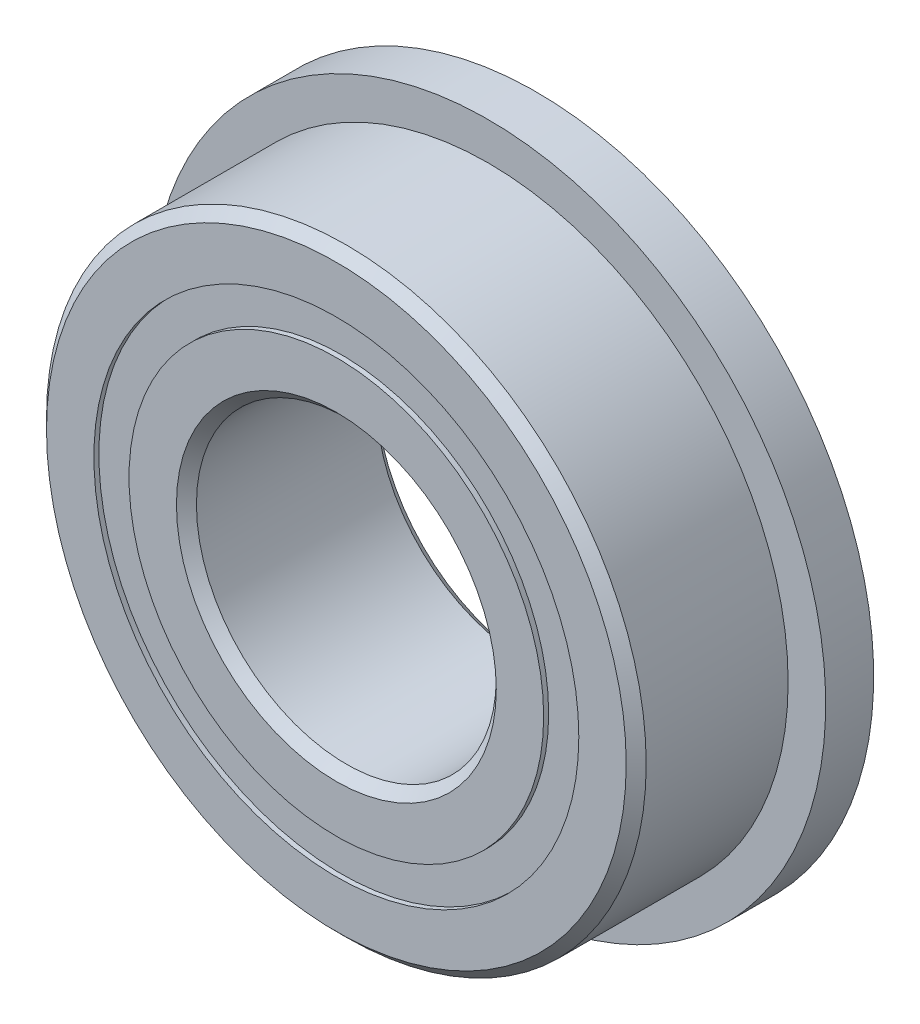
ISO-10303-21;
HEADER;
FILE_DESCRIPTION(('STEP AP214'),'2;1');
FILE_NAME('part.step','',(''),(''),'','','');
FILE_SCHEMA(('AUTOMOTIVE_DESIGN { 1 0 10303 214 1 1 1 1 }'));
ENDSEC;
DATA;
#1=APPLICATION_CONTEXT('core data for automotive mechanical design processes');
#2=APPLICATION_PROTOCOL_DEFINITION('international standard','automotive_design',2000,#1);
#3=PRODUCT_CONTEXT('',#1,'mechanical');
#4=PRODUCT('Part','Part','',(#3));
#5=PRODUCT_RELATED_PRODUCT_CATEGORY('part','',(#4));
#6=PRODUCT_DEFINITION_FORMATION('','',#4);
#7=PRODUCT_DEFINITION_CONTEXT('part definition',#1,'design');
#8=PRODUCT_DEFINITION('design','',#6,#7);
#9=PRODUCT_DEFINITION_SHAPE('','',#8);
#10=(LENGTH_UNIT() NAMED_UNIT(*) SI_UNIT(.MILLI.,.METRE.));
#11=(NAMED_UNIT(*) PLANE_ANGLE_UNIT() SI_UNIT($,.RADIAN.));
#12=(NAMED_UNIT(*) SI_UNIT($,.STERADIAN.) SOLID_ANGLE_UNIT());
#13=UNCERTAINTY_MEASURE_WITH_UNIT(LENGTH_MEASURE(1.E-05),#10,'distance_accuracy_value','');
#14=(GEOMETRIC_REPRESENTATION_CONTEXT(3) GLOBAL_UNCERTAINTY_ASSIGNED_CONTEXT((#13)) GLOBAL_UNIT_ASSIGNED_CONTEXT((#10,
#11,#12)) REPRESENTATION_CONTEXT('',''));
#15=CARTESIAN_POINT('',(0.,0.,0.));
#16=DIRECTION('',(0.,0.,1.));
#17=DIRECTION('',(1.,0.,0.));
#18=AXIS2_PLACEMENT_3D('',#15,#16,#17);
#19=CARTESIAN_POINT('',(0.,3.85099587912088,-1.508125));
#20=DIRECTION('',(0.,0.,1.));
#21=DIRECTION('',(1.,0.,0.));
#22=AXIS2_PLACEMENT_3D('',#19,#20,#21);
#23=PLANE('',#22);
#24=CARTESIAN_POINT('',(0.,0.,-1.508125));
#25=DIRECTION('',(0.,0.,1.));
#26=DIRECTION('',(1.,0.,0.));
#27=AXIS2_PLACEMENT_3D('',#24,#25,#26);
#28=CIRCLE('',#27,3.85099587912088);
#29=CARTESIAN_POINT('',(3.85099587912088,0.,-1.508125));
#30=VERTEX_POINT('',#29);
#31=EDGE_CURVE('E60',#30,#30,#28,.T.);
#32=ORIENTED_EDGE('',*,*,#31,.F.);
#33=EDGE_LOOP('',(#32));
#34=FACE_BOUND('',#33,.T.);
#35=CARTESIAN_POINT('',(0.,0.,-1.508125));
#36=DIRECTION('',(0.,0.,1.));
#37=DIRECTION('',(1.,0.,0.));
#38=AXIS2_PLACEMENT_3D('',#35,#36,#37);
#39=CIRCLE('',#38,3.29275412087912);
#40=CARTESIAN_POINT('',(3.29275412087912,0.,-1.508125));
#41=VERTEX_POINT('',#40);
#42=EDGE_CURVE('E11',#41,#41,#39,.T.);
#43=ORIENTED_EDGE('',*,*,#42,.T.);
#44=EDGE_LOOP('',(#43));
#45=FACE_BOUND('',#44,.T.);
#46=ADVANCED_FACE('F46',(#34,#45),#23,.F.);
#47=CARTESIAN_POINT('',(0.,0.,1.5875));
#48=DIRECTION('',(0.,0.,1.));
#49=DIRECTION('',(1.,0.,0.));
#50=AXIS2_PLACEMENT_3D('',#47,#48,#49);
#51=CYLINDRICAL_SURFACE('',#50,3.29275412087912);
#52=ORIENTED_EDGE('',*,*,#42,.F.);
#53=EDGE_LOOP('',(#52));
#54=FACE_BOUND('',#53,.T.);
#55=CARTESIAN_POINT('',(0.,0.,-0.758760243513405));
#56=DIRECTION('',(0.,0.,1.));
#57=DIRECTION('',(1.,0.,0.));
#58=AXIS2_PLACEMENT_3D('',#55,#56,#57);
#59=CIRCLE('',#58,3.29275412087912);
#60=CARTESIAN_POINT('',(3.29275412087912,0.,-0.758760243513405));
#61=VERTEX_POINT('',#60);
#62=EDGE_CURVE('E52',#61,#61,#59,.T.);
#63=ORIENTED_EDGE('',*,*,#62,.T.);
#64=EDGE_LOOP('',(#63));
#65=FACE_BOUND('',#64,.T.);
#66=ADVANCED_FACE('F69',(#54,#65),#51,.F.);
#67=CARTESIAN_POINT('',(0.,3.85099587912088,-0.758760243513405));
#68=DIRECTION('',(0.,0.,-1.));
#69=DIRECTION('',(-1.,0.,0.));
#70=AXIS2_PLACEMENT_3D('',#67,#68,#69);
#71=PLANE('',#70);
#72=ORIENTED_EDGE('',*,*,#62,.F.);
#73=EDGE_LOOP('',(#72));
#74=FACE_BOUND('',#73,.T.);
#75=CARTESIAN_POINT('',(0.,0.,-0.758760243513405));
#76=DIRECTION('',(0.,0.,1.));
#77=DIRECTION('',(1.,0.,0.));
#78=AXIS2_PLACEMENT_3D('',#75,#76,#77);
#79=CIRCLE('',#78,3.85099587912088);
#80=CARTESIAN_POINT('',(3.85099587912088,0.,-0.758760243513405));
#81=VERTEX_POINT('',#80);
#82=EDGE_CURVE('E56',#81,#81,#79,.T.);
#83=ORIENTED_EDGE('',*,*,#82,.T.);
#84=EDGE_LOOP('',(#83));
#85=FACE_BOUND('',#84,.T.);
#86=ADVANCED_FACE('F73',(#74,#85),#71,.F.);
#87=CARTESIAN_POINT('',(0.,0.,1.5875));
#88=DIRECTION('',(0.,0.,1.));
#89=DIRECTION('',(1.,0.,0.));
#90=AXIS2_PLACEMENT_3D('',#87,#88,#89);
#91=CYLINDRICAL_SURFACE('',#90,3.85099587912088);
#92=ORIENTED_EDGE('',*,*,#82,.F.);
#93=EDGE_LOOP('',(#92));
#94=FACE_BOUND('',#93,.T.);
#95=ORIENTED_EDGE('',*,*,#31,.T.);
#96=EDGE_LOOP('',(#95));
#97=FACE_BOUND('',#96,.T.);
#98=ADVANCED_FACE('F66',(#94,#97),#91,.T.);
#99=CLOSED_SHELL('',(#46,#66,#86,#98));
#100=MANIFOLD_SOLID_BREP('B2',#99);
#101=CARTESIAN_POINT('',(0.,3.85099587912088,1.508125));
#102=DIRECTION('',(0.,0.,-1.));
#103=DIRECTION('',(-1.,0.,0.));
#104=AXIS2_PLACEMENT_3D('',#101,#102,#103);
#105=PLANE('',#104);
#106=CARTESIAN_POINT('',(0.,0.,1.508125));
#107=DIRECTION('',(0.,0.,1.));
#108=DIRECTION('',(1.,0.,0.));
#109=AXIS2_PLACEMENT_3D('',#106,#107,#108);
#110=CIRCLE('',#109,3.29275412087912);
#111=CARTESIAN_POINT('',(3.29275412087912,0.,1.508125));
#112=VERTEX_POINT('',#111);
#113=EDGE_CURVE('E45',#112,#112,#110,.T.);
#114=ORIENTED_EDGE('',*,*,#113,.F.);
#115=EDGE_LOOP('',(#114));
#116=FACE_BOUND('',#115,.T.);
#117=CARTESIAN_POINT('',(0.,0.,1.508125));
#118=DIRECTION('',(0.,0.,1.));
#119=DIRECTION('',(1.,0.,0.));
#120=AXIS2_PLACEMENT_3D('',#117,#118,#119);
#121=CIRCLE('',#120,3.85099587912088);
#122=CARTESIAN_POINT('',(3.85099587912088,0.,1.508125));
#123=VERTEX_POINT('',#122);
#124=EDGE_CURVE('E128',#123,#123,#121,.T.);
#125=ORIENTED_EDGE('',*,*,#124,.T.);
#126=EDGE_LOOP('',(#125));
#127=FACE_BOUND('',#126,.T.);
#128=ADVANCED_FACE('F114',(#116,#127),#105,.F.);
#129=CARTESIAN_POINT('',(0.,0.,1.5875));
#130=DIRECTION('',(0.,0.,1.));
#131=DIRECTION('',(1.,0.,0.));
#132=AXIS2_PLACEMENT_3D('',#129,#130,#131);
#133=CYLINDRICAL_SURFACE('',#132,3.29275412087912);
#134=CARTESIAN_POINT('',(0.,0.,0.758760243513404));
#135=DIRECTION('',(0.,0.,1.));
#136=DIRECTION('',(1.,0.,0.));
#137=AXIS2_PLACEMENT_3D('',#134,#135,#136);
#138=CIRCLE('',#137,3.29275412087912);
#139=CARTESIAN_POINT('',(3.29275412087912,0.,0.758760243513404));
#140=VERTEX_POINT('',#139);
#141=EDGE_CURVE('E120',#140,#140,#138,.T.);
#142=ORIENTED_EDGE('',*,*,#141,.F.);
#143=EDGE_LOOP('',(#142));
#144=FACE_BOUND('',#143,.T.);
#145=ORIENTED_EDGE('',*,*,#113,.T.);
#146=EDGE_LOOP('',(#145));
#147=FACE_BOUND('',#146,.T.);
#148=ADVANCED_FACE('F143',(#144,#147),#133,.F.);
#149=CARTESIAN_POINT('',(0.,3.85099587912088,0.758760243513405));
#150=DIRECTION('',(0.,0.,1.));
#151=DIRECTION('',(1.,0.,0.));
#152=AXIS2_PLACEMENT_3D('',#149,#150,#151);
#153=PLANE('',#152);
#154=CARTESIAN_POINT('',(0.,0.,0.758760243513405));
#155=DIRECTION('',(0.,0.,1.));
#156=DIRECTION('',(1.,0.,0.));
#157=AXIS2_PLACEMENT_3D('',#154,#155,#156);
#158=CIRCLE('',#157,3.85099587912088);
#159=CARTESIAN_POINT('',(3.85099587912088,0.,0.758760243513405));
#160=VERTEX_POINT('',#159);
#161=EDGE_CURVE('E124',#160,#160,#158,.T.);
#162=ORIENTED_EDGE('',*,*,#161,.F.);
#163=EDGE_LOOP('',(#162));
#164=FACE_BOUND('',#163,.T.);
#165=ORIENTED_EDGE('',*,*,#141,.T.);
#166=EDGE_LOOP('',(#165));
#167=FACE_BOUND('',#166,.T.);
#168=ADVANCED_FACE('F138',(#164,#167),#153,.F.);
#169=CARTESIAN_POINT('',(0.,0.,1.5875));
#170=DIRECTION('',(0.,0.,1.));
#171=DIRECTION('',(1.,0.,0.));
#172=AXIS2_PLACEMENT_3D('',#169,#170,#171);
#173=CYLINDRICAL_SURFACE('',#172,3.85099587912088);
#174=ORIENTED_EDGE('',*,*,#124,.F.);
#175=EDGE_LOOP('',(#174));
#176=FACE_BOUND('',#175,.T.);
#177=ORIENTED_EDGE('',*,*,#161,.T.);
#178=EDGE_LOOP('',(#177));
#179=FACE_BOUND('',#178,.T.);
#180=ADVANCED_FACE('F135',(#176,#179),#173,.T.);
#181=CLOSED_SHELL('',(#128,#148,#168,#180));
#182=MANIFOLD_SOLID_BREP('B6',#181);
#183=CARTESIAN_POINT('',(-1.78593749999996,3.09333448914257,0.));
#184=DIRECTION('',(0.,0.,1.));
#185=DIRECTION('',(-0.499999999999989,0.866025403784445,0.));
#186=AXIS2_PLACEMENT_3D('',#183,#184,#185);
#187=SPHERICAL_SURFACE('',#186,0.758760243513405);
#188=CARTESIAN_POINT('',(-1.78593749999996,3.09333448914257,0.758760243513405));
#189=VERTEX_POINT('',#188);
#190=VERTEX_LOOP('',#189);
#191=FACE_BOUND('',#190,.T.);
#192=ADVANCED_FACE('F182',(#191),#187,.T.);
#193=CLOSED_SHELL('',(#192));
#194=MANIFOLD_SOLID_BREP('B40',#193);
#195=CARTESIAN_POINT('',(-3.09333448914252,1.78593750000004,0.));
#196=DIRECTION('',(0.,0.,1.));
#197=DIRECTION('',(-0.866025403784433,0.50000000000001,0.));
#198=AXIS2_PLACEMENT_3D('',#195,#196,#197);
#199=SPHERICAL_SURFACE('',#198,0.758760243513405);
#200=CARTESIAN_POINT('',(-3.09333448914252,1.78593750000004,0.758760243513405));
#201=VERTEX_POINT('',#200);
#202=VERTEX_LOOP('',#201);
#203=FACE_BOUND('',#202,.T.);
#204=ADVANCED_FACE('F203',(#203),#199,.T.);
#205=CLOSED_SHELL('',(#204));
#206=MANIFOLD_SOLID_BREP('B110',#205);
#207=CARTESIAN_POINT('',(-3.571875,0.,0.));
#208=DIRECTION('',(0.,0.,1.));
#209=DIRECTION('',(-1.,0.,0.));
#210=AXIS2_PLACEMENT_3D('',#207,#208,#209);
#211=SPHERICAL_SURFACE('',#210,0.758760243513405);
#212=CARTESIAN_POINT('',(-3.571875,0.,0.758760243513405));
#213=VERTEX_POINT('',#212);
#214=VERTEX_LOOP('',#213);
#215=FACE_BOUND('',#214,.T.);
#216=ADVANCED_FACE('F224',(#215),#211,.T.);
#217=CLOSED_SHELL('',(#216));
#218=MANIFOLD_SOLID_BREP('B178',#217);
#219=CARTESIAN_POINT('',(-3.09333448914256,-1.78593749999997,0.));
#220=DIRECTION('',(0.,0.,1.));
#221=DIRECTION('',(-0.866025403784443,-0.499999999999992,0.));
#222=AXIS2_PLACEMENT_3D('',#219,#220,#221);
#223=SPHERICAL_SURFACE('',#222,0.758760243513405);
#224=CARTESIAN_POINT('',(-3.09333448914256,-1.78593749999997,0.758760243513405));
#225=VERTEX_POINT('',#224);
#226=VERTEX_LOOP('',#225);
#227=FACE_BOUND('',#226,.T.);
#228=ADVANCED_FACE('F245',(#227),#223,.T.);
#229=CLOSED_SHELL('',(#228));
#230=MANIFOLD_SOLID_BREP('B199',#229);
#231=CARTESIAN_POINT('',(-1.78593750000003,-3.09333448914253,0.));
#232=DIRECTION('',(0.,0.,1.));
#233=DIRECTION('',(-0.500000000000007,-0.866025403784435,0.));
#234=AXIS2_PLACEMENT_3D('',#231,#232,#233);
#235=SPHERICAL_SURFACE('',#234,0.758760243513405);
#236=CARTESIAN_POINT('',(-1.78593750000003,-3.09333448914253,0.758760243513405));
#237=VERTEX_POINT('',#236);
#238=VERTEX_LOOP('',#237);
#239=FACE_BOUND('',#238,.T.);
#240=ADVANCED_FACE('F266',(#239),#235,.T.);
#241=CLOSED_SHELL('',(#240));
#242=MANIFOLD_SOLID_BREP('B220',#241);
#243=CARTESIAN_POINT('',(0.,-3.571875,0.));
#244=DIRECTION('',(0.,0.,1.));
#245=DIRECTION('',(0.,-1.,0.));
#246=AXIS2_PLACEMENT_3D('',#243,#244,#245);
#247=SPHERICAL_SURFACE('',#246,0.758760243513405);
#248=CARTESIAN_POINT('',(0.,-3.571875,0.758760243513405));
#249=VERTEX_POINT('',#248);
#250=VERTEX_LOOP('',#249);
#251=FACE_BOUND('',#250,.T.);
#252=ADVANCED_FACE('F287',(#251),#247,.T.);
#253=CLOSED_SHELL('',(#252));
#254=MANIFOLD_SOLID_BREP('B241',#253);
#255=CARTESIAN_POINT('',(1.78593749999998,-3.09333448914255,0.));
#256=DIRECTION('',(0.,0.,1.));
#257=DIRECTION('',(0.499999999999995,-0.866025403784442,0.));
#258=AXIS2_PLACEMENT_3D('',#255,#256,#257);
#259=SPHERICAL_SURFACE('',#258,0.758760243513405);
#260=CARTESIAN_POINT('',(1.78593749999998,-3.09333448914255,0.758760243513405));
#261=VERTEX_POINT('',#260);
#262=VERTEX_LOOP('',#261);
#263=FACE_BOUND('',#262,.T.);
#264=ADVANCED_FACE('F308',(#263),#259,.T.);
#265=CLOSED_SHELL('',(#264));
#266=MANIFOLD_SOLID_BREP('B262',#265);
#267=CARTESIAN_POINT('',(3.09333448914253,-1.78593750000001,0.));
#268=DIRECTION('',(0.,0.,1.));
#269=DIRECTION('',(0.866025403784436,-0.500000000000004,0.));
#270=AXIS2_PLACEMENT_3D('',#267,#268,#269);
#271=SPHERICAL_SURFACE('',#270,0.758760243513405);
#272=CARTESIAN_POINT('',(3.09333448914253,-1.78593750000001,0.758760243513405));
#273=VERTEX_POINT('',#272);
#274=VERTEX_LOOP('',#273);
#275=FACE_BOUND('',#274,.T.);
#276=ADVANCED_FACE('F329',(#275),#271,.T.);
#277=CLOSED_SHELL('',(#276));
#278=MANIFOLD_SOLID_BREP('B283',#277);
#279=CARTESIAN_POINT('',(3.571875,0.,0.));
#280=DIRECTION('',(0.,0.,1.));
#281=DIRECTION('',(1.,0.,0.));
#282=AXIS2_PLACEMENT_3D('',#279,#280,#281);
#283=SPHERICAL_SURFACE('',#282,0.758760243513405);
#284=CARTESIAN_POINT('',(3.571875,0.,0.758760243513405));
#285=VERTEX_POINT('',#284);
#286=VERTEX_LOOP('',#285);
#287=FACE_BOUND('',#286,.T.);
#288=ADVANCED_FACE('F350',(#287),#283,.T.);
#289=CLOSED_SHELL('',(#288));
#290=MANIFOLD_SOLID_BREP('B304',#289);
#291=CARTESIAN_POINT('',(3.09333448914255,1.78593749999999,0.));
#292=DIRECTION('',(0.,0.,1.));
#293=DIRECTION('',(0.86602540378444,0.499999999999998,0.));
#294=AXIS2_PLACEMENT_3D('',#291,#292,#293);
#295=SPHERICAL_SURFACE('',#294,0.758760243513405);
#296=CARTESIAN_POINT('',(3.09333448914255,1.78593749999999,0.758760243513405));
#297=VERTEX_POINT('',#296);
#298=VERTEX_LOOP('',#297);
#299=FACE_BOUND('',#298,.T.);
#300=ADVANCED_FACE('F371',(#299),#295,.T.);
#301=CLOSED_SHELL('',(#300));
#302=MANIFOLD_SOLID_BREP('B325',#301);
#303=CARTESIAN_POINT('',(1.7859375,3.09333448914254,0.));
#304=DIRECTION('',(0.,0.,1.));
#305=DIRECTION('',(0.500000000000001,0.866025403784438,0.));
#306=AXIS2_PLACEMENT_3D('',#303,#304,#305);
#307=SPHERICAL_SURFACE('',#306,0.758760243513405);
#308=CARTESIAN_POINT('',(1.7859375,3.09333448914254,0.758760243513405));
#309=VERTEX_POINT('',#308);
#310=VERTEX_LOOP('',#309);
#311=FACE_BOUND('',#310,.T.);
#312=ADVANCED_FACE('F392',(#311),#307,.T.);
#313=CLOSED_SHELL('',(#312));
#314=MANIFOLD_SOLID_BREP('B346',#313);
#315=CARTESIAN_POINT('',(0.,3.571875,0.));
#316=DIRECTION('',(0.,0.,1.));
#317=DIRECTION('',(0.,1.,0.));
#318=AXIS2_PLACEMENT_3D('',#315,#316,#317);
#319=SPHERICAL_SURFACE('',#318,0.758760243513405);
#320=CARTESIAN_POINT('',(0.,3.571875,0.758760243513405));
#321=VERTEX_POINT('',#320);
#322=VERTEX_LOOP('',#321);
#323=FACE_BOUND('',#322,.T.);
#324=ADVANCED_FACE('F415',(#323),#319,.T.);
#325=CLOSED_SHELL('',(#324));
#326=MANIFOLD_SOLID_BREP('B367',#325);
#327=CARTESIAN_POINT('',(0.,3.29275412087912,1.5875));
#328=DIRECTION('',(0.,0.,-1.));
#329=DIRECTION('',(-1.,0.,0.));
#330=AXIS2_PLACEMENT_3D('',#327,#328,#329);
#331=PLANE('',#330);
#332=CARTESIAN_POINT('',(0.,0.,1.5875));
#333=DIRECTION('',(0.,0.,1.));
#334=DIRECTION('',(1.,0.,0.));
#335=AXIS2_PLACEMENT_3D('',#332,#333,#334);
#336=CIRCLE('',#335,2.54);
#337=CARTESIAN_POINT('',(2.54,0.,1.5875));
#338=VERTEX_POINT('',#337);
#339=EDGE_CURVE('E463',#338,#338,#336,.T.);
#340=ORIENTED_EDGE('',*,*,#339,.F.);
#341=EDGE_LOOP('',(#340));
#342=FACE_BOUND('',#341,.T.);
#343=CARTESIAN_POINT('',(0.,0.,1.5875));
#344=DIRECTION('',(0.,0.,1.));
#345=DIRECTION('',(1.,0.,0.));
#346=AXIS2_PLACEMENT_3D('',#343,#344,#345);
#347=CIRCLE('',#346,3.29275412087912);
#348=CARTESIAN_POINT('',(3.29275412087912,0.,1.5875));
#349=VERTEX_POINT('',#348);
#350=EDGE_CURVE('E414',#349,#349,#347,.T.);
#351=ORIENTED_EDGE('',*,*,#350,.T.);
#352=EDGE_LOOP('',(#351));
#353=FACE_BOUND('',#352,.T.);
#354=ADVANCED_FACE('F435',(#342,#353),#331,.F.);
#355=CARTESIAN_POINT('',(0.,0.,1.5875));
#356=DIRECTION('',(0.,0.,1.));
#357=DIRECTION('',(1.,0.,0.));
#358=AXIS2_PLACEMENT_3D('',#355,#356,#357);
#359=CYLINDRICAL_SURFACE('',#358,3.29275412087912);
#360=ORIENTED_EDGE('',*,*,#350,.F.);
#361=EDGE_LOOP('',(#360));
#362=FACE_BOUND('',#361,.T.);
#363=CARTESIAN_POINT('',(0.,0.,0.705555555555555));
#364=DIRECTION('',(0.,0.,1.));
#365=DIRECTION('',(1.,0.,0.));
#366=AXIS2_PLACEMENT_3D('',#363,#364,#365);
#367=CIRCLE('',#366,3.29275412087912);
#368=CARTESIAN_POINT('',(3.29275412087912,0.,0.705555555555555));
#369=VERTEX_POINT('',#368);
#370=EDGE_CURVE('E441',#369,#369,#367,.T.);
#371=ORIENTED_EDGE('',*,*,#370,.T.);
#372=EDGE_LOOP('',(#371));
#373=FACE_BOUND('',#372,.T.);
#374=ADVANCED_FACE('F470',(#362,#373),#359,.T.);
#375=CARTESIAN_POINT('',(0.,0.,0.));
#376=DIRECTION('',(0.,0.,1.));
#377=DIRECTION('',(1.,0.,0.));
#378=AXIS2_PLACEMENT_3D('',#375,#376,#377);
#379=TOROIDAL_SURFACE('',#378,3.571875,0.758760243513404);
#380=ORIENTED_EDGE('',*,*,#370,.F.);
#381=EDGE_LOOP('',(#380));
#382=FACE_BOUND('',#381,.T.);
#383=CARTESIAN_POINT('',(0.,0.,-0.705555555555556));
#384=DIRECTION('',(0.,0.,1.));
#385=DIRECTION('',(1.,0.,0.));
#386=AXIS2_PLACEMENT_3D('',#383,#384,#385);
#387=CIRCLE('',#386,3.29275412087912);
#388=CARTESIAN_POINT('',(3.29275412087912,0.,-0.705555555555556));
#389=VERTEX_POINT('',#388);
#390=EDGE_CURVE('E445',#389,#389,#387,.T.);
#391=ORIENTED_EDGE('',*,*,#390,.T.);
#392=EDGE_LOOP('',(#391));
#393=FACE_BOUND('',#392,.T.);
#394=ADVANCED_FACE('F474',(#382,#393),#379,.F.);
#395=CARTESIAN_POINT('',(0.,0.,1.5875));
#396=DIRECTION('',(0.,0.,1.));
#397=DIRECTION('',(1.,0.,0.));
#398=AXIS2_PLACEMENT_3D('',#395,#396,#397);
#399=CYLINDRICAL_SURFACE('',#398,3.29275412087912);
#400=ORIENTED_EDGE('',*,*,#390,.F.);
#401=EDGE_LOOP('',(#400));
#402=FACE_BOUND('',#401,.T.);
#403=CARTESIAN_POINT('',(0.,0.,-1.5875));
#404=DIRECTION('',(0.,0.,1.));
#405=DIRECTION('',(1.,0.,0.));
#406=AXIS2_PLACEMENT_3D('',#403,#404,#405);
#407=CIRCLE('',#406,3.29275412087912);
#408=CARTESIAN_POINT('',(3.29275412087912,0.,-1.5875));
#409=VERTEX_POINT('',#408);
#410=EDGE_CURVE('E449',#409,#409,#407,.T.);
#411=ORIENTED_EDGE('',*,*,#410,.T.);
#412=EDGE_LOOP('',(#411));
#413=FACE_BOUND('',#412,.T.);
#414=ADVANCED_FACE('F479',(#402,#413),#399,.T.);
#415=CARTESIAN_POINT('',(0.,2.54,-1.5875));
#416=DIRECTION('',(0.,0.,1.));
#417=DIRECTION('',(1.,0.,0.));
#418=AXIS2_PLACEMENT_3D('',#415,#416,#417);
#419=PLANE('',#418);
#420=ORIENTED_EDGE('',*,*,#410,.F.);
#421=EDGE_LOOP('',(#420));
#422=FACE_BOUND('',#421,.T.);
#423=CARTESIAN_POINT('',(0.,0.,-1.5875));
#424=DIRECTION('',(0.,0.,1.));
#425=DIRECTION('',(1.,0.,0.));
#426=AXIS2_PLACEMENT_3D('',#423,#424,#425);
#427=CIRCLE('',#426,2.54);
#428=CARTESIAN_POINT('',(2.54,0.,-1.5875));
#429=VERTEX_POINT('',#428);
#430=EDGE_CURVE('E454',#429,#429,#427,.T.);
#431=ORIENTED_EDGE('',*,*,#430,.T.);
#432=EDGE_LOOP('',(#431));
#433=FACE_BOUND('',#432,.T.);
#434=ADVANCED_FACE('F485',(#422,#433),#419,.F.);
#435=CARTESIAN_POINT('',(0.,0.,-1.42875));
#436=DIRECTION('',(0.,0.,-1.));
#437=DIRECTION('',(-1.,0.,0.));
#438=AXIS2_PLACEMENT_3D('',#435,#436,#437);
#439=CONICAL_SURFACE('',#438,2.38125,0.785398163397446);
#440=ORIENTED_EDGE('',*,*,#430,.F.);
#441=EDGE_LOOP('',(#440));
#442=FACE_BOUND('',#441,.T.);
#443=CARTESIAN_POINT('',(0.,0.,-1.42875));
#444=DIRECTION('',(0.,0.,1.));
#445=DIRECTION('',(1.,0.,0.));
#446=AXIS2_PLACEMENT_3D('',#443,#444,#445);
#447=CIRCLE('',#446,2.38125);
#448=CARTESIAN_POINT('',(2.38125,0.,-1.42875));
#449=VERTEX_POINT('',#448);
#450=EDGE_CURVE('E457',#449,#449,#447,.T.);
#451=ORIENTED_EDGE('',*,*,#450,.T.);
#452=EDGE_LOOP('',(#451));
#453=FACE_BOUND('',#452,.T.);
#454=ADVANCED_FACE('F489',(#442,#453),#439,.F.);
#455=CARTESIAN_POINT('',(0.,0.,1.5875));
#456=DIRECTION('',(0.,0.,1.));
#457=DIRECTION('',(1.,0.,0.));
#458=AXIS2_PLACEMENT_3D('',#455,#456,#457);
#459=CYLINDRICAL_SURFACE('',#458,2.38125);
#460=ORIENTED_EDGE('',*,*,#450,.F.);
#461=EDGE_LOOP('',(#460));
#462=FACE_BOUND('',#461,.T.);
#463=CARTESIAN_POINT('',(0.,0.,1.42875));
#464=DIRECTION('',(0.,0.,1.));
#465=DIRECTION('',(1.,0.,0.));
#466=AXIS2_PLACEMENT_3D('',#463,#464,#465);
#467=CIRCLE('',#466,2.38125);
#468=CARTESIAN_POINT('',(2.38125,0.,1.42875));
#469=VERTEX_POINT('',#468);
#470=EDGE_CURVE('E460',#469,#469,#467,.T.);
#471=ORIENTED_EDGE('',*,*,#470,.T.);
#472=EDGE_LOOP('',(#471));
#473=FACE_BOUND('',#472,.T.);
#474=ADVANCED_FACE('F493',(#462,#473),#459,.F.);
#475=CARTESIAN_POINT('',(0.,0.,1.5875));
#476=DIRECTION('',(0.,0.,1.));
#477=DIRECTION('',(1.,0.,0.));
#478=AXIS2_PLACEMENT_3D('',#475,#476,#477);
#479=CONICAL_SURFACE('',#478,2.54,0.78539816339745);
#480=ORIENTED_EDGE('',*,*,#470,.F.);
#481=EDGE_LOOP('',(#480));
#482=FACE_BOUND('',#481,.T.);
#483=ORIENTED_EDGE('',*,*,#339,.T.);
#484=EDGE_LOOP('',(#483));
#485=FACE_BOUND('',#484,.T.);
#486=ADVANCED_FACE('F467',(#482,#485),#479,.F.);
#487=CLOSED_SHELL('',(#354,#374,#394,#414,#434,#454,#474,#486));
#488=MANIFOLD_SOLID_BREP('B388',#487);
#489=CARTESIAN_POINT('',(0.,0.,1.42875));
#490=DIRECTION('',(0.,0.,-1.));
#491=DIRECTION('',(-1.,0.,0.));
#492=AXIS2_PLACEMENT_3D('',#489,#490,#491);
#493=CONICAL_SURFACE('',#492,4.7625,0.785398163397446);
#494=CARTESIAN_POINT('',(0.,0.,1.5875));
#495=DIRECTION('',(0.,0.,1.));
#496=DIRECTION('',(1.,0.,0.));
#497=AXIS2_PLACEMENT_3D('',#494,#495,#496);
#498=CIRCLE('',#497,4.60375);
#499=CARTESIAN_POINT('',(4.60375,0.,1.5875));
#500=VERTEX_POINT('',#499);
#501=EDGE_CURVE('E579',#500,#500,#498,.T.);
#502=ORIENTED_EDGE('',*,*,#501,.F.);
#503=EDGE_LOOP('',(#502));
#504=FACE_BOUND('',#503,.T.);
#505=CARTESIAN_POINT('',(0.,0.,1.42875));
#506=DIRECTION('',(0.,0.,1.));
#507=DIRECTION('',(1.,0.,0.));
#508=AXIS2_PLACEMENT_3D('',#505,#506,#507);
#509=CIRCLE('',#508,4.7625);
#510=CARTESIAN_POINT('',(4.7625,0.,1.42875));
#511=VERTEX_POINT('',#510);
#512=EDGE_CURVE('E434',#511,#511,#509,.T.);
#513=ORIENTED_EDGE('',*,*,#512,.T.);
#514=EDGE_LOOP('',(#513));
#515=FACE_BOUND('',#514,.T.);
#516=ADVANCED_FACE('F557',(#504,#515),#493,.T.);
#517=CARTESIAN_POINT('',(0.,0.,1.5875));
#518=DIRECTION('',(0.,0.,1.));
#519=DIRECTION('',(1.,0.,0.));
#520=AXIS2_PLACEMENT_3D('',#517,#518,#519);
#521=CYLINDRICAL_SURFACE('',#520,4.7625);
#522=CARTESIAN_POINT('',(0.,0.,-0.825499999999999));
#523=DIRECTION('',(0.,0.,1.));
#524=DIRECTION('',(1.,0.,0.));
#525=AXIS2_PLACEMENT_3D('',#522,#523,#524);
#526=CIRCLE('',#525,4.7625);
#527=CARTESIAN_POINT('',(4.7625,0.,-0.825499999999999));
#528=VERTEX_POINT('',#527);
#529=EDGE_CURVE('E582',#528,#528,#526,.T.);
#530=ORIENTED_EDGE('',*,*,#529,.T.);
#531=EDGE_LOOP('',(#530));
#532=FACE_BOUND('',#531,.T.);
#533=ORIENTED_EDGE('',*,*,#512,.F.);
#534=EDGE_LOOP('',(#533));
#535=FACE_BOUND('',#534,.T.);
#536=ADVANCED_FACE('F602',(#532,#535),#521,.T.);
#537=CARTESIAN_POINT('',(0.,4.60375,-1.5875));
#538=DIRECTION('',(0.,0.,1.));
#539=DIRECTION('',(1.,0.,0.));
#540=AXIS2_PLACEMENT_3D('',#537,#538,#539);
#541=PLANE('',#540);
#542=CARTESIAN_POINT('',(0.,0.,-1.5875));
#543=DIRECTION('',(0.,0.,1.));
#544=DIRECTION('',(1.,0.,0.));
#545=AXIS2_PLACEMENT_3D('',#542,#543,#544);
#546=CIRCLE('',#545,3.85099587912088);
#547=CARTESIAN_POINT('',(3.85099587912088,0.,-1.5875));
#548=VERTEX_POINT('',#547);
#549=EDGE_CURVE('E563',#548,#548,#546,.T.);
#550=ORIENTED_EDGE('',*,*,#549,.T.);
#551=EDGE_LOOP('',(#550));
#552=FACE_BOUND('',#551,.T.);
#553=CARTESIAN_POINT('',(0.,0.,-1.5875));
#554=DIRECTION('',(0.,0.,-1.));
#555=DIRECTION('',(-1.,0.,0.));
#556=AXIS2_PLACEMENT_3D('',#553,#554,#555);
#557=CIRCLE('',#556,5.3594);
#558=CARTESIAN_POINT('',(-5.3594,0.,-1.5875));
#559=VERTEX_POINT('',#558);
#560=EDGE_CURVE('E585',#559,#559,#557,.T.);
#561=ORIENTED_EDGE('',*,*,#560,.T.);
#562=EDGE_LOOP('',(#561));
#563=FACE_BOUND('',#562,.T.);
#564=ADVANCED_FACE('F605',(#552,#563),#541,.F.);
#565=CARTESIAN_POINT('',(0.,0.,1.5875));
#566=DIRECTION('',(0.,0.,1.));
#567=DIRECTION('',(1.,0.,0.));
#568=AXIS2_PLACEMENT_3D('',#565,#566,#567);
#569=CYLINDRICAL_SURFACE('',#568,3.85099587912088);
#570=CARTESIAN_POINT('',(0.,0.,-0.705555555555555));
#571=DIRECTION('',(0.,0.,1.));
#572=DIRECTION('',(1.,0.,0.));
#573=AXIS2_PLACEMENT_3D('',#570,#571,#572);
#574=CIRCLE('',#573,3.85099587912088);
#575=CARTESIAN_POINT('',(3.85099587912088,0.,-0.705555555555555));
#576=VERTEX_POINT('',#575);
#577=EDGE_CURVE('E567',#576,#576,#574,.T.);
#578=ORIENTED_EDGE('',*,*,#577,.T.);
#579=EDGE_LOOP('',(#578));
#580=FACE_BOUND('',#579,.T.);
#581=ORIENTED_EDGE('',*,*,#549,.F.);
#582=EDGE_LOOP('',(#581));
#583=FACE_BOUND('',#582,.T.);
#584=ADVANCED_FACE('F610',(#580,#583),#569,.F.);
#585=CARTESIAN_POINT('',(0.,0.,0.));
#586=DIRECTION('',(0.,0.,1.));
#587=DIRECTION('',(1.,0.,0.));
#588=AXIS2_PLACEMENT_3D('',#585,#586,#587);
#589=TOROIDAL_SURFACE('',#588,3.571875,0.758760243513405);
#590=ORIENTED_EDGE('',*,*,#577,.F.);
#591=EDGE_LOOP('',(#590));
#592=FACE_BOUND('',#591,.T.);
#593=CARTESIAN_POINT('',(0.,0.,0.705555555555555));
#594=DIRECTION('',(0.,0.,1.));
#595=DIRECTION('',(1.,0.,0.));
#596=AXIS2_PLACEMENT_3D('',#593,#594,#595);
#597=CIRCLE('',#596,3.85099587912088);
#598=CARTESIAN_POINT('',(3.85099587912088,0.,0.705555555555555));
#599=VERTEX_POINT('',#598);
#600=EDGE_CURVE('E571',#599,#599,#597,.T.);
#601=ORIENTED_EDGE('',*,*,#600,.T.);
#602=EDGE_LOOP('',(#601));
#603=FACE_BOUND('',#602,.T.);
#604=ADVANCED_FACE('F616',(#592,#603),#589,.F.);
#605=CARTESIAN_POINT('',(0.,0.,1.5875));
#606=DIRECTION('',(0.,0.,1.));
#607=DIRECTION('',(1.,0.,0.));
#608=AXIS2_PLACEMENT_3D('',#605,#606,#607);
#609=CYLINDRICAL_SURFACE('',#608,3.85099587912088);
#610=ORIENTED_EDGE('',*,*,#600,.F.);
#611=EDGE_LOOP('',(#610));
#612=FACE_BOUND('',#611,.T.);
#613=CARTESIAN_POINT('',(0.,0.,1.5875));
#614=DIRECTION('',(0.,0.,1.));
#615=DIRECTION('',(1.,0.,0.));
#616=AXIS2_PLACEMENT_3D('',#613,#614,#615);
#617=CIRCLE('',#616,3.85099587912088);
#618=CARTESIAN_POINT('',(3.85099587912088,0.,1.5875));
#619=VERTEX_POINT('',#618);
#620=EDGE_CURVE('E576',#619,#619,#617,.T.);
#621=ORIENTED_EDGE('',*,*,#620,.T.);
#622=EDGE_LOOP('',(#621));
#623=FACE_BOUND('',#622,.T.);
#624=ADVANCED_FACE('F620',(#612,#623),#609,.F.);
#625=CARTESIAN_POINT('',(0.,4.60375,1.5875));
#626=DIRECTION('',(0.,0.,-1.));
#627=DIRECTION('',(-1.,0.,0.));
#628=AXIS2_PLACEMENT_3D('',#625,#626,#627);
#629=PLANE('',#628);
#630=ORIENTED_EDGE('',*,*,#620,.F.);
#631=EDGE_LOOP('',(#630));
#632=FACE_BOUND('',#631,.T.);
#633=ORIENTED_EDGE('',*,*,#501,.T.);
#634=EDGE_LOOP('',(#633));
#635=FACE_BOUND('',#634,.T.);
#636=ADVANCED_FACE('F598',(#632,#635),#629,.F.);
#637=CARTESIAN_POINT('',(0.,3.85099587912088,-0.825499999999999));
#638=DIRECTION('',(0.,0.,1.));
#639=DIRECTION('',(1.,0.,0.));
#640=AXIS2_PLACEMENT_3D('',#637,#638,#639);
#641=PLANE('',#640);
#642=CARTESIAN_POINT('',(0.,0.,-0.825499999999999));
#643=DIRECTION('',(0.,0.,-1.));
#644=DIRECTION('',(-1.,0.,0.));
#645=AXIS2_PLACEMENT_3D('',#642,#643,#644);
#646=CIRCLE('',#645,5.3594);
#647=CARTESIAN_POINT('',(-5.3594,0.,-0.825499999999999));
#648=VERTEX_POINT('',#647);
#649=EDGE_CURVE('E588',#648,#648,#646,.T.);
#650=ORIENTED_EDGE('',*,*,#649,.F.);
#651=EDGE_LOOP('',(#650));
#652=FACE_BOUND('',#651,.T.);
#653=ORIENTED_EDGE('',*,*,#529,.F.);
#654=EDGE_LOOP('',(#653));
#655=FACE_BOUND('',#654,.T.);
#656=ADVANCED_FACE('F595',(#652,#655),#641,.T.);
#657=CARTESIAN_POINT('',(0.,0.,-1.5875));
#658=DIRECTION('',(0.,0.,-1.));
#659=DIRECTION('',(-1.,0.,0.));
#660=AXIS2_PLACEMENT_3D('',#657,#658,#659);
#661=CYLINDRICAL_SURFACE('',#660,5.3594);
#662=ORIENTED_EDGE('',*,*,#649,.T.);
#663=EDGE_LOOP('',(#662));
#664=FACE_BOUND('',#663,.T.);
#665=ORIENTED_EDGE('',*,*,#560,.F.);
#666=EDGE_LOOP('',(#665));
#667=FACE_BOUND('',#666,.T.);
#668=ADVANCED_FACE('F592',(#664,#667),#661,.T.);
#669=CLOSED_SHELL('',(#516,#536,#564,#584,#604,#624,#636,#656,#668));
#670=MANIFOLD_SOLID_BREP('B409',#669);
#671=ADVANCED_BREP_SHAPE_REPRESENTATION('',(#18,#100,#182,#194,#206,#218,#230,#242,#254,#266,
#278,#290,#302,#314,#326,#488,#670),#14);
#672=SHAPE_DEFINITION_REPRESENTATION(#9,#671);
ENDSEC;
END-ISO-10303-21;
